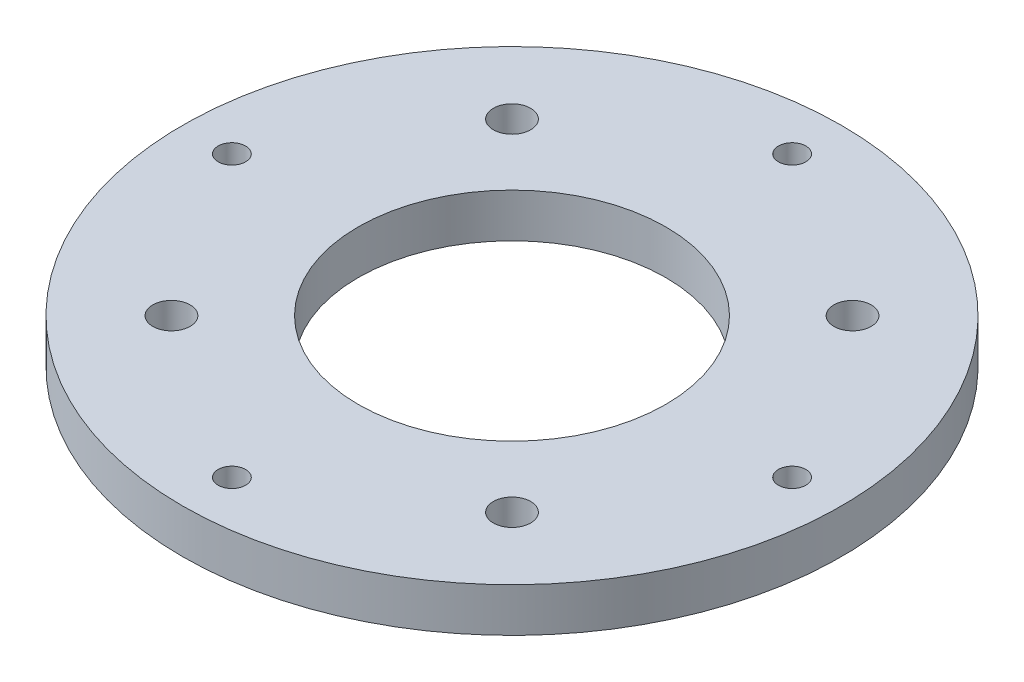
ISO-10303-21;
HEADER;
FILE_DESCRIPTION(('STEP AP214'),'2;1');
FILE_NAME('part.step','',(''),(''),'','','');
FILE_SCHEMA(('AUTOMOTIVE_DESIGN { 1 0 10303 214 1 1 1 1 }'));
ENDSEC;
DATA;
#1=APPLICATION_CONTEXT('core data for automotive mechanical design processes');
#2=APPLICATION_PROTOCOL_DEFINITION('international standard','automotive_design',2000,#1);
#3=PRODUCT_CONTEXT('',#1,'mechanical');
#4=PRODUCT('Part','Part','',(#3));
#5=PRODUCT_RELATED_PRODUCT_CATEGORY('part','',(#4));
#6=PRODUCT_DEFINITION_FORMATION('','',#4);
#7=PRODUCT_DEFINITION_CONTEXT('part definition',#1,'design');
#8=PRODUCT_DEFINITION('design','',#6,#7);
#9=PRODUCT_DEFINITION_SHAPE('','',#8);
#10=(LENGTH_UNIT() NAMED_UNIT(*) SI_UNIT(.MILLI.,.METRE.));
#11=(NAMED_UNIT(*) PLANE_ANGLE_UNIT() SI_UNIT($,.RADIAN.));
#12=(NAMED_UNIT(*) SI_UNIT($,.STERADIAN.) SOLID_ANGLE_UNIT());
#13=UNCERTAINTY_MEASURE_WITH_UNIT(LENGTH_MEASURE(1.E-05),#10,'distance_accuracy_value','');
#14=(GEOMETRIC_REPRESENTATION_CONTEXT(3) GLOBAL_UNCERTAINTY_ASSIGNED_CONTEXT((#13)) GLOBAL_UNIT_ASSIGNED_CONTEXT((#10,
#11,#12)) REPRESENTATION_CONTEXT('',''));
#15=CARTESIAN_POINT('',(0.,0.,0.));
#16=DIRECTION('',(0.,0.,1.));
#17=DIRECTION('',(1.,0.,0.));
#18=AXIS2_PLACEMENT_3D('',#15,#16,#17);
#19=CARTESIAN_POINT('',(0.,-4.,0.));
#20=DIRECTION('',(0.,1.,0.));
#21=DIRECTION('',(0.,0.,1.));
#22=AXIS2_PLACEMENT_3D('',#19,#20,#21);
#23=CYLINDRICAL_SURFACE('',#22,30.);
#24=CARTESIAN_POINT('',(0.,-4.,0.));
#25=DIRECTION('',(0.,1.,0.));
#26=DIRECTION('',(0.,0.,1.));
#27=AXIS2_PLACEMENT_3D('',#24,#25,#26);
#28=CIRCLE('',#27,30.);
#29=CARTESIAN_POINT('',(0.,-4.,30.));
#30=VERTEX_POINT('',#29);
#31=EDGE_CURVE('E10',#30,#30,#28,.T.);
#32=ORIENTED_EDGE('',*,*,#31,.T.);
#33=EDGE_LOOP('',(#32));
#34=FACE_BOUND('',#33,.T.);
#35=CARTESIAN_POINT('',(0.,0.,0.));
#36=DIRECTION('',(0.,1.,0.));
#37=DIRECTION('',(0.,0.,1.));
#38=AXIS2_PLACEMENT_3D('',#35,#36,#37);
#39=CIRCLE('',#38,30.);
#40=CARTESIAN_POINT('',(0.,0.,30.));
#41=VERTEX_POINT('',#40);
#42=EDGE_CURVE('E45',#41,#41,#39,.T.);
#43=ORIENTED_EDGE('',*,*,#42,.F.);
#44=EDGE_LOOP('',(#43));
#45=FACE_BOUND('',#44,.T.);
#46=ADVANCED_FACE('F42',(#34,#45),#23,.T.);
#47=CARTESIAN_POINT('',(0.,-4.,0.));
#48=DIRECTION('',(0.,1.,0.));
#49=DIRECTION('',(0.,0.,1.));
#50=AXIS2_PLACEMENT_3D('',#47,#48,#49);
#51=PLANE('',#50);
#52=CARTESIAN_POINT('',(0.,-4.,0.));
#53=DIRECTION('',(0.,-1.,0.));
#54=DIRECTION('',(0.,0.,-1.));
#55=AXIS2_PLACEMENT_3D('',#52,#53,#54);
#56=CIRCLE('',#55,14.);
#57=CARTESIAN_POINT('',(0.,-4.,-14.));
#58=VERTEX_POINT('',#57);
#59=EDGE_CURVE('E114',#58,#58,#56,.T.);
#60=ORIENTED_EDGE('',*,*,#59,.F.);
#61=EDGE_LOOP('',(#60));
#62=FACE_BOUND('',#61,.T.);
#63=CARTESIAN_POINT('',(15.5,-4.,15.5));
#64=DIRECTION('',(0.,-1.,0.));
#65=DIRECTION('',(0.,0.,-1.));
#66=AXIS2_PLACEMENT_3D('',#63,#64,#65);
#67=CIRCLE('',#66,3.15);
#68=CARTESIAN_POINT('',(15.5,-4.,12.35));
#69=VERTEX_POINT('',#68);
#70=EDGE_CURVE('E110',#69,#69,#67,.T.);
#71=ORIENTED_EDGE('',*,*,#70,.F.);
#72=EDGE_LOOP('',(#71));
#73=FACE_BOUND('',#72,.T.);
#74=CARTESIAN_POINT('',(-15.5,-4.,15.5));
#75=DIRECTION('',(0.,-1.,0.));
#76=DIRECTION('',(0.,0.,-1.));
#77=AXIS2_PLACEMENT_3D('',#74,#75,#76);
#78=CIRCLE('',#77,3.15);
#79=CARTESIAN_POINT('',(-15.5,-4.,12.35));
#80=VERTEX_POINT('',#79);
#81=EDGE_CURVE('E101',#80,#80,#78,.T.);
#82=ORIENTED_EDGE('',*,*,#81,.F.);
#83=EDGE_LOOP('',(#82));
#84=FACE_BOUND('',#83,.T.);
#85=CARTESIAN_POINT('',(15.5,-4.,-15.5));
#86=DIRECTION('',(0.,-1.,0.));
#87=DIRECTION('',(0.,0.,-1.));
#88=AXIS2_PLACEMENT_3D('',#85,#86,#87);
#89=CIRCLE('',#88,3.15);
#90=CARTESIAN_POINT('',(15.5,-4.,-18.65));
#91=VERTEX_POINT('',#90);
#92=EDGE_CURVE('E92',#91,#91,#89,.T.);
#93=ORIENTED_EDGE('',*,*,#92,.F.);
#94=EDGE_LOOP('',(#93));
#95=FACE_BOUND('',#94,.T.);
#96=CARTESIAN_POINT('',(-15.5,-4.,-15.5));
#97=DIRECTION('',(0.,-1.,0.));
#98=DIRECTION('',(0.,0.,-1.));
#99=AXIS2_PLACEMENT_3D('',#96,#97,#98);
#100=CIRCLE('',#99,3.15);
#101=CARTESIAN_POINT('',(-15.5,-4.,-18.65));
#102=VERTEX_POINT('',#101);
#103=EDGE_CURVE('E83',#102,#102,#100,.T.);
#104=ORIENTED_EDGE('',*,*,#103,.F.);
#105=EDGE_LOOP('',(#104));
#106=FACE_BOUND('',#105,.T.);
#107=CARTESIAN_POINT('',(0.,-4.,-25.5));
#108=DIRECTION('',(0.,1.,0.));
#109=DIRECTION('',(0.,0.,1.));
#110=AXIS2_PLACEMENT_3D('',#107,#108,#109);
#111=CIRCLE('',#110,1.25);
#112=CARTESIAN_POINT('',(0.,-4.,-24.25));
#113=VERTEX_POINT('',#112);
#114=EDGE_CURVE('E71',#113,#113,#111,.T.);
#115=ORIENTED_EDGE('',*,*,#114,.T.);
#116=EDGE_LOOP('',(#115));
#117=FACE_BOUND('',#116,.T.);
#118=CARTESIAN_POINT('',(25.5000000000007,-4.,-7.20069316468564E-13));
#119=DIRECTION('',(0.,1.,0.));
#120=DIRECTION('',(0.,0.,1.));
#121=AXIS2_PLACEMENT_3D('',#118,#119,#120);
#122=CIRCLE('',#121,1.25);
#123=CARTESIAN_POINT('',(25.5000000000007,-4.,1.24999999999928));
#124=VERTEX_POINT('',#123);
#125=EDGE_CURVE('E65',#124,#124,#122,.T.);
#126=ORIENTED_EDGE('',*,*,#125,.T.);
#127=EDGE_LOOP('',(#126));
#128=FACE_BOUND('',#127,.T.);
#129=CARTESIAN_POINT('',(1.44013863293713E-12,-4.,25.5));
#130=DIRECTION('',(0.,1.,0.));
#131=DIRECTION('',(0.,0.,1.));
#132=AXIS2_PLACEMENT_3D('',#129,#130,#131);
#133=CIRCLE('',#132,1.25);
#134=CARTESIAN_POINT('',(1.44013863293713E-12,-4.,26.75));
#135=VERTEX_POINT('',#134);
#136=EDGE_CURVE('E59',#135,#135,#133,.T.);
#137=ORIENTED_EDGE('',*,*,#136,.T.);
#138=EDGE_LOOP('',(#137));
#139=FACE_BOUND('',#138,.T.);
#140=CARTESIAN_POINT('',(-25.4999999999993,-4.,7.16946467130738E-13));
#141=DIRECTION('',(0.,1.,0.));
#142=DIRECTION('',(0.,0.,1.));
#143=AXIS2_PLACEMENT_3D('',#140,#141,#142);
#144=CIRCLE('',#143,1.25);
#145=CARTESIAN_POINT('',(-25.4999999999993,-4.,1.25000000000071));
#146=VERTEX_POINT('',#145);
#147=EDGE_CURVE('E52',#146,#146,#144,.T.);
#148=ORIENTED_EDGE('',*,*,#147,.T.);
#149=EDGE_LOOP('',(#148));
#150=FACE_BOUND('',#149,.T.);
#151=ORIENTED_EDGE('',*,*,#31,.F.);
#152=EDGE_LOOP('',(#151));
#153=FACE_BOUND('',#152,.T.);
#154=ADVANCED_FACE('F130',(#62,#73,#84,#95,#106,#117,#128,#139,#150,#153),#51,.F.);
#155=CARTESIAN_POINT('',(0.,0.,0.));
#156=DIRECTION('',(0.,1.,0.));
#157=DIRECTION('',(0.,0.,1.));
#158=AXIS2_PLACEMENT_3D('',#155,#156,#157);
#159=PLANE('',#158);
#160=CARTESIAN_POINT('',(0.,0.,0.));
#161=DIRECTION('',(0.,-1.,0.));
#162=DIRECTION('',(0.,0.,-1.));
#163=AXIS2_PLACEMENT_3D('',#160,#161,#162);
#164=CIRCLE('',#163,14.);
#165=CARTESIAN_POINT('',(0.,0.,-14.));
#166=VERTEX_POINT('',#165);
#167=EDGE_CURVE('E113',#166,#166,#164,.T.);
#168=ORIENTED_EDGE('',*,*,#167,.T.);
#169=EDGE_LOOP('',(#168));
#170=FACE_BOUND('',#169,.T.);
#171=CARTESIAN_POINT('',(15.5,0.,15.5));
#172=DIRECTION('',(0.,-1.,0.));
#173=DIRECTION('',(0.,0.,-1.));
#174=AXIS2_PLACEMENT_3D('',#171,#172,#173);
#175=CIRCLE('',#174,1.7);
#176=CARTESIAN_POINT('',(15.5,0.,13.8));
#177=VERTEX_POINT('',#176);
#178=EDGE_CURVE('E104',#177,#177,#175,.T.);
#179=ORIENTED_EDGE('',*,*,#178,.T.);
#180=EDGE_LOOP('',(#179));
#181=FACE_BOUND('',#180,.T.);
#182=CARTESIAN_POINT('',(-15.5,0.,15.5));
#183=DIRECTION('',(0.,-1.,0.));
#184=DIRECTION('',(0.,0.,-1.));
#185=AXIS2_PLACEMENT_3D('',#182,#183,#184);
#186=CIRCLE('',#185,1.7);
#187=CARTESIAN_POINT('',(-15.5,0.,13.8));
#188=VERTEX_POINT('',#187);
#189=EDGE_CURVE('E95',#188,#188,#186,.T.);
#190=ORIENTED_EDGE('',*,*,#189,.T.);
#191=EDGE_LOOP('',(#190));
#192=FACE_BOUND('',#191,.T.);
#193=CARTESIAN_POINT('',(15.5,0.,-15.5));
#194=DIRECTION('',(0.,-1.,0.));
#195=DIRECTION('',(0.,0.,-1.));
#196=AXIS2_PLACEMENT_3D('',#193,#194,#195);
#197=CIRCLE('',#196,1.7);
#198=CARTESIAN_POINT('',(15.5,0.,-17.2));
#199=VERTEX_POINT('',#198);
#200=EDGE_CURVE('E86',#199,#199,#197,.T.);
#201=ORIENTED_EDGE('',*,*,#200,.T.);
#202=EDGE_LOOP('',(#201));
#203=FACE_BOUND('',#202,.T.);
#204=CARTESIAN_POINT('',(-15.5,0.,-15.5));
#205=DIRECTION('',(0.,-1.,0.));
#206=DIRECTION('',(0.,0.,-1.));
#207=AXIS2_PLACEMENT_3D('',#204,#205,#206);
#208=CIRCLE('',#207,1.7);
#209=CARTESIAN_POINT('',(-15.5,0.,-17.2));
#210=VERTEX_POINT('',#209);
#211=EDGE_CURVE('E77',#210,#210,#208,.T.);
#212=ORIENTED_EDGE('',*,*,#211,.T.);
#213=EDGE_LOOP('',(#212));
#214=FACE_BOUND('',#213,.T.);
#215=CARTESIAN_POINT('',(0.,0.,-25.5));
#216=DIRECTION('',(0.,1.,0.));
#217=DIRECTION('',(0.,0.,1.));
#218=AXIS2_PLACEMENT_3D('',#215,#216,#217);
#219=CIRCLE('',#218,1.25);
#220=CARTESIAN_POINT('',(0.,0.,-24.25));
#221=VERTEX_POINT('',#220);
#222=EDGE_CURVE('E74',#221,#221,#219,.T.);
#223=ORIENTED_EDGE('',*,*,#222,.F.);
#224=EDGE_LOOP('',(#223));
#225=FACE_BOUND('',#224,.T.);
#226=CARTESIAN_POINT('',(25.5000000000007,0.,-7.20069316468564E-13));
#227=DIRECTION('',(0.,1.,0.));
#228=DIRECTION('',(0.,0.,1.));
#229=AXIS2_PLACEMENT_3D('',#226,#227,#228);
#230=CIRCLE('',#229,1.25);
#231=CARTESIAN_POINT('',(25.5000000000007,0.,1.24999999999928));
#232=VERTEX_POINT('',#231);
#233=EDGE_CURVE('E68',#232,#232,#230,.T.);
#234=ORIENTED_EDGE('',*,*,#233,.F.);
#235=EDGE_LOOP('',(#234));
#236=FACE_BOUND('',#235,.T.);
#237=CARTESIAN_POINT('',(1.44013863293713E-12,0.,25.5));
#238=DIRECTION('',(0.,1.,0.));
#239=DIRECTION('',(0.,0.,1.));
#240=AXIS2_PLACEMENT_3D('',#237,#238,#239);
#241=CIRCLE('',#240,1.25);
#242=CARTESIAN_POINT('',(1.44013863293713E-12,0.,26.75));
#243=VERTEX_POINT('',#242);
#244=EDGE_CURVE('E62',#243,#243,#241,.T.);
#245=ORIENTED_EDGE('',*,*,#244,.F.);
#246=EDGE_LOOP('',(#245));
#247=FACE_BOUND('',#246,.T.);
#248=CARTESIAN_POINT('',(-25.4999999999993,0.,7.16946467130738E-13));
#249=DIRECTION('',(0.,1.,0.));
#250=DIRECTION('',(0.,0.,1.));
#251=AXIS2_PLACEMENT_3D('',#248,#249,#250);
#252=CIRCLE('',#251,1.25);
#253=CARTESIAN_POINT('',(-25.4999999999993,0.,1.25000000000072));
#254=VERTEX_POINT('',#253);
#255=EDGE_CURVE('E56',#254,#254,#252,.T.);
#256=ORIENTED_EDGE('',*,*,#255,.F.);
#257=EDGE_LOOP('',(#256));
#258=FACE_BOUND('',#257,.T.);
#259=ORIENTED_EDGE('',*,*,#42,.T.);
#260=EDGE_LOOP('',(#259));
#261=FACE_BOUND('',#260,.T.);
#262=ADVANCED_FACE('F120',(#170,#181,#192,#203,#214,#225,#236,#247,#258,#261),#159,.T.);
#263=CARTESIAN_POINT('',(-25.4999999999993,0.,7.16946467130738E-13));
#264=DIRECTION('',(0.,1.,0.));
#265=DIRECTION('',(0.,0.,1.));
#266=AXIS2_PLACEMENT_3D('',#263,#264,#265);
#267=CYLINDRICAL_SURFACE('',#266,1.25);
#268=ORIENTED_EDGE('',*,*,#147,.F.);
#269=EDGE_LOOP('',(#268));
#270=FACE_BOUND('',#269,.T.);
#271=ORIENTED_EDGE('',*,*,#255,.T.);
#272=EDGE_LOOP('',(#271));
#273=FACE_BOUND('',#272,.T.);
#274=ADVANCED_FACE('F151',(#270,#273),#267,.F.);
#275=CARTESIAN_POINT('',(1.44013863293713E-12,0.,25.5));
#276=DIRECTION('',(0.,1.,0.));
#277=DIRECTION('',(0.,0.,1.));
#278=AXIS2_PLACEMENT_3D('',#275,#276,#277);
#279=CYLINDRICAL_SURFACE('',#278,1.25);
#280=ORIENTED_EDGE('',*,*,#136,.F.);
#281=EDGE_LOOP('',(#280));
#282=FACE_BOUND('',#281,.T.);
#283=ORIENTED_EDGE('',*,*,#244,.T.);
#284=EDGE_LOOP('',(#283));
#285=FACE_BOUND('',#284,.T.);
#286=ADVANCED_FACE('F154',(#282,#285),#279,.F.);
#287=CARTESIAN_POINT('',(25.5000000000007,0.,-7.20069316468564E-13));
#288=DIRECTION('',(0.,1.,0.));
#289=DIRECTION('',(0.,0.,1.));
#290=AXIS2_PLACEMENT_3D('',#287,#288,#289);
#291=CYLINDRICAL_SURFACE('',#290,1.25);
#292=ORIENTED_EDGE('',*,*,#125,.F.);
#293=EDGE_LOOP('',(#292));
#294=FACE_BOUND('',#293,.T.);
#295=ORIENTED_EDGE('',*,*,#233,.T.);
#296=EDGE_LOOP('',(#295));
#297=FACE_BOUND('',#296,.T.);
#298=ADVANCED_FACE('F193',(#294,#297),#291,.F.);
#299=CARTESIAN_POINT('',(0.,0.,-25.5));
#300=DIRECTION('',(0.,1.,0.));
#301=DIRECTION('',(0.,0.,1.));
#302=AXIS2_PLACEMENT_3D('',#299,#300,#301);
#303=CYLINDRICAL_SURFACE('',#302,1.25);
#304=ORIENTED_EDGE('',*,*,#114,.F.);
#305=EDGE_LOOP('',(#304));
#306=FACE_BOUND('',#305,.T.);
#307=ORIENTED_EDGE('',*,*,#222,.T.);
#308=EDGE_LOOP('',(#307));
#309=FACE_BOUND('',#308,.T.);
#310=ADVANCED_FACE('F201',(#306,#309),#303,.F.);
#311=CARTESIAN_POINT('',(-15.5,-4.,-15.5));
#312=DIRECTION('',(0.,-1.,0.));
#313=DIRECTION('',(0.,0.,-1.));
#314=AXIS2_PLACEMENT_3D('',#311,#312,#313);
#315=CYLINDRICAL_SURFACE('',#314,1.7);
#316=ORIENTED_EDGE('',*,*,#211,.F.);
#317=EDGE_LOOP('',(#316));
#318=FACE_BOUND('',#317,.T.);
#319=CARTESIAN_POINT('',(-15.5,-2.55,-15.5));
#320=DIRECTION('',(0.,-1.,0.));
#321=DIRECTION('',(0.,0.,-1.));
#322=AXIS2_PLACEMENT_3D('',#319,#320,#321);
#323=CIRCLE('',#322,1.7);
#324=CARTESIAN_POINT('',(-15.5,-2.55,-17.2));
#325=VERTEX_POINT('',#324);
#326=EDGE_CURVE('E80',#325,#325,#323,.T.);
#327=ORIENTED_EDGE('',*,*,#326,.T.);
#328=EDGE_LOOP('',(#327));
#329=FACE_BOUND('',#328,.T.);
#330=ADVANCED_FACE('F209',(#318,#329),#315,.F.);
#331=CARTESIAN_POINT('',(-15.5,-4.,-15.5));
#332=DIRECTION('',(0.,-1.,0.));
#333=DIRECTION('',(0.,0.,-1.));
#334=AXIS2_PLACEMENT_3D('',#331,#332,#333);
#335=CONICAL_SURFACE('',#334,3.15,0.785398163397448);
#336=ORIENTED_EDGE('',*,*,#326,.F.);
#337=EDGE_LOOP('',(#336));
#338=FACE_BOUND('',#337,.T.);
#339=ORIENTED_EDGE('',*,*,#103,.T.);
#340=EDGE_LOOP('',(#339));
#341=FACE_BOUND('',#340,.T.);
#342=ADVANCED_FACE('F217',(#338,#341),#335,.F.);
#343=CARTESIAN_POINT('',(15.5,-4.,-15.5));
#344=DIRECTION('',(0.,-1.,0.));
#345=DIRECTION('',(0.,0.,-1.));
#346=AXIS2_PLACEMENT_3D('',#343,#344,#345);
#347=CYLINDRICAL_SURFACE('',#346,1.7);
#348=ORIENTED_EDGE('',*,*,#200,.F.);
#349=EDGE_LOOP('',(#348));
#350=FACE_BOUND('',#349,.T.);
#351=CARTESIAN_POINT('',(15.5,-2.55,-15.5));
#352=DIRECTION('',(0.,-1.,0.));
#353=DIRECTION('',(0.,0.,-1.));
#354=AXIS2_PLACEMENT_3D('',#351,#352,#353);
#355=CIRCLE('',#354,1.7);
#356=CARTESIAN_POINT('',(15.5,-2.55,-17.2));
#357=VERTEX_POINT('',#356);
#358=EDGE_CURVE('E89',#357,#357,#355,.T.);
#359=ORIENTED_EDGE('',*,*,#358,.T.);
#360=EDGE_LOOP('',(#359));
#361=FACE_BOUND('',#360,.T.);
#362=ADVANCED_FACE('F227',(#350,#361),#347,.F.);
#363=CARTESIAN_POINT('',(15.5,-4.,-15.5));
#364=DIRECTION('',(0.,-1.,0.));
#365=DIRECTION('',(0.,0.,-1.));
#366=AXIS2_PLACEMENT_3D('',#363,#364,#365);
#367=CONICAL_SURFACE('',#366,3.15,0.785398163397449);
#368=ORIENTED_EDGE('',*,*,#358,.F.);
#369=EDGE_LOOP('',(#368));
#370=FACE_BOUND('',#369,.T.);
#371=ORIENTED_EDGE('',*,*,#92,.T.);
#372=EDGE_LOOP('',(#371));
#373=FACE_BOUND('',#372,.T.);
#374=ADVANCED_FACE('F235',(#370,#373),#367,.F.);
#375=CARTESIAN_POINT('',(-15.5,-4.,15.5));
#376=DIRECTION('',(0.,-1.,0.));
#377=DIRECTION('',(0.,0.,-1.));
#378=AXIS2_PLACEMENT_3D('',#375,#376,#377);
#379=CYLINDRICAL_SURFACE('',#378,1.7);
#380=ORIENTED_EDGE('',*,*,#189,.F.);
#381=EDGE_LOOP('',(#380));
#382=FACE_BOUND('',#381,.T.);
#383=CARTESIAN_POINT('',(-15.5,-2.55,15.5));
#384=DIRECTION('',(0.,-1.,0.));
#385=DIRECTION('',(0.,0.,-1.));
#386=AXIS2_PLACEMENT_3D('',#383,#384,#385);
#387=CIRCLE('',#386,1.7);
#388=CARTESIAN_POINT('',(-15.5,-2.55,13.8));
#389=VERTEX_POINT('',#388);
#390=EDGE_CURVE('E98',#389,#389,#387,.T.);
#391=ORIENTED_EDGE('',*,*,#390,.T.);
#392=EDGE_LOOP('',(#391));
#393=FACE_BOUND('',#392,.T.);
#394=ADVANCED_FACE('F243',(#382,#393),#379,.F.);
#395=CARTESIAN_POINT('',(-15.5,-4.,15.5));
#396=DIRECTION('',(0.,-1.,0.));
#397=DIRECTION('',(0.,0.,-1.));
#398=AXIS2_PLACEMENT_3D('',#395,#396,#397);
#399=CONICAL_SURFACE('',#398,3.15,0.785398163397448);
#400=ORIENTED_EDGE('',*,*,#390,.F.);
#401=EDGE_LOOP('',(#400));
#402=FACE_BOUND('',#401,.T.);
#403=ORIENTED_EDGE('',*,*,#81,.T.);
#404=EDGE_LOOP('',(#403));
#405=FACE_BOUND('',#404,.T.);
#406=ADVANCED_FACE('F251',(#402,#405),#399,.F.);
#407=CARTESIAN_POINT('',(15.5,-4.,15.5));
#408=DIRECTION('',(0.,-1.,0.));
#409=DIRECTION('',(0.,0.,-1.));
#410=AXIS2_PLACEMENT_3D('',#407,#408,#409);
#411=CYLINDRICAL_SURFACE('',#410,1.7);
#412=ORIENTED_EDGE('',*,*,#178,.F.);
#413=EDGE_LOOP('',(#412));
#414=FACE_BOUND('',#413,.T.);
#415=CARTESIAN_POINT('',(15.5,-2.55,15.5));
#416=DIRECTION('',(0.,-1.,0.));
#417=DIRECTION('',(0.,0.,-1.));
#418=AXIS2_PLACEMENT_3D('',#415,#416,#417);
#419=CIRCLE('',#418,1.7);
#420=CARTESIAN_POINT('',(15.5,-2.55,13.8));
#421=VERTEX_POINT('',#420);
#422=EDGE_CURVE('E107',#421,#421,#419,.T.);
#423=ORIENTED_EDGE('',*,*,#422,.T.);
#424=EDGE_LOOP('',(#423));
#425=FACE_BOUND('',#424,.T.);
#426=ADVANCED_FACE('F259',(#414,#425),#411,.F.);
#427=CARTESIAN_POINT('',(15.5,-4.,15.5));
#428=DIRECTION('',(0.,-1.,0.));
#429=DIRECTION('',(0.,0.,-1.));
#430=AXIS2_PLACEMENT_3D('',#427,#428,#429);
#431=CONICAL_SURFACE('',#430,3.15,0.785398163397449);
#432=ORIENTED_EDGE('',*,*,#422,.F.);
#433=EDGE_LOOP('',(#432));
#434=FACE_BOUND('',#433,.T.);
#435=ORIENTED_EDGE('',*,*,#70,.T.);
#436=EDGE_LOOP('',(#435));
#437=FACE_BOUND('',#436,.T.);
#438=ADVANCED_FACE('F126',(#434,#437),#431,.F.);
#439=CARTESIAN_POINT('',(0.,0.,0.));
#440=DIRECTION('',(0.,-1.,0.));
#441=DIRECTION('',(0.,0.,-1.));
#442=AXIS2_PLACEMENT_3D('',#439,#440,#441);
#443=CYLINDRICAL_SURFACE('',#442,14.);
#444=ORIENTED_EDGE('',*,*,#167,.F.);
#445=EDGE_LOOP('',(#444));
#446=FACE_BOUND('',#445,.T.);
#447=ORIENTED_EDGE('',*,*,#59,.T.);
#448=EDGE_LOOP('',(#447));
#449=FACE_BOUND('',#448,.T.);
#450=ADVANCED_FACE('F123',(#446,#449),#443,.F.);
#451=CLOSED_SHELL('',(#46,#154,#262,#274,#286,#298,#310,#330,#342,#362,#374,#394,#406,#426,#438,#450));
#452=MANIFOLD_SOLID_BREP('B2',#451);
#453=ADVANCED_BREP_SHAPE_REPRESENTATION('',(#18,#452),#14);
#454=SHAPE_DEFINITION_REPRESENTATION(#9,#453);
ENDSEC;
END-ISO-10303-21;
